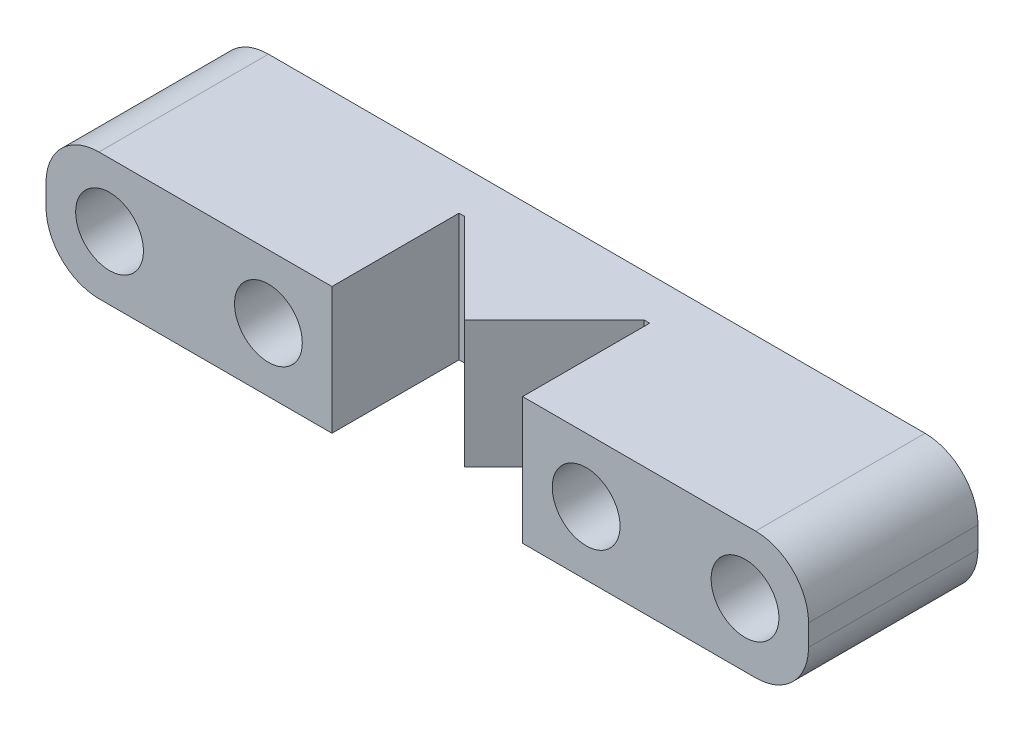
ISO-10303-21;
HEADER;
FILE_DESCRIPTION(('STEP AP214'),'2;1');
FILE_NAME('part.step','',(''),(''),'','','');
FILE_SCHEMA(('AUTOMOTIVE_DESIGN { 1 0 10303 214 1 1 1 1 }'));
ENDSEC;
DATA;
#1=APPLICATION_CONTEXT('core data for automotive mechanical design processes');
#2=APPLICATION_PROTOCOL_DEFINITION('international standard','automotive_design',2000,#1);
#3=PRODUCT_CONTEXT('',#1,'mechanical');
#4=PRODUCT('Part','Part','',(#3));
#5=PRODUCT_RELATED_PRODUCT_CATEGORY('part','',(#4));
#6=PRODUCT_DEFINITION_FORMATION('','',#4);
#7=PRODUCT_DEFINITION_CONTEXT('part definition',#1,'design');
#8=PRODUCT_DEFINITION('design','',#6,#7);
#9=PRODUCT_DEFINITION_SHAPE('','',#8);
#10=(LENGTH_UNIT() NAMED_UNIT(*) SI_UNIT(.MILLI.,.METRE.));
#11=(NAMED_UNIT(*) PLANE_ANGLE_UNIT() SI_UNIT($,.RADIAN.));
#12=(NAMED_UNIT(*) SI_UNIT($,.STERADIAN.) SOLID_ANGLE_UNIT());
#13=UNCERTAINTY_MEASURE_WITH_UNIT(LENGTH_MEASURE(1.E-05),#10,'distance_accuracy_value','');
#14=(GEOMETRIC_REPRESENTATION_CONTEXT(3) GLOBAL_UNCERTAINTY_ASSIGNED_CONTEXT((#13)) GLOBAL_UNIT_ASSIGNED_CONTEXT((#10,
#11,#12)) REPRESENTATION_CONTEXT('',''));
#15=CARTESIAN_POINT('',(0.,0.,0.));
#16=DIRECTION('',(0.,0.,1.));
#17=DIRECTION('',(1.,0.,0.));
#18=AXIS2_PLACEMENT_3D('',#15,#16,#17);
#19=CARTESIAN_POINT('',(3.,5.,2.));
#20=DIRECTION('',(0.,0.,-1.));
#21=DIRECTION('',(-1.,0.,0.));
#22=AXIS2_PLACEMENT_3D('',#19,#20,#21);
#23=PLANE('',#22);
#24=DIRECTION('',(1.,0.,0.));
#25=VECTOR('',#24,1.);
#26=CARTESIAN_POINT('',(3.,-3.,2.));
#27=LINE('',#26,#25);
#28=CARTESIAN_POINT('',(3.,-3.,2.));
#29=VERTEX_POINT('',#28);
#30=CARTESIAN_POINT('',(3.25735931288069,-3.,2.));
#31=VERTEX_POINT('',#30);
#32=EDGE_CURVE('E249',#29,#31,#27,.T.);
#33=ORIENTED_EDGE('',*,*,#32,.T.);
#34=DIRECTION('',(0.,-1.,0.));
#35=VECTOR('',#34,1.);
#36=CARTESIAN_POINT('',(3.25735931288069,12.4868329805051,2.));
#37=LINE('',#36,#35);
#38=CARTESIAN_POINT('',(3.25735931288069,3.,2.));
#39=VERTEX_POINT('',#38);
#40=EDGE_CURVE('E237',#39,#31,#37,.T.);
#41=ORIENTED_EDGE('',*,*,#40,.F.);
#42=DIRECTION('',(1.,0.,0.));
#43=VECTOR('',#42,1.);
#44=CARTESIAN_POINT('',(-0.499999999999983,3.,2.));
#45=LINE('',#44,#43);
#46=CARTESIAN_POINT('',(3.,3.,2.));
#47=VERTEX_POINT('',#46);
#48=EDGE_CURVE('E258',#47,#39,#45,.T.);
#49=ORIENTED_EDGE('',*,*,#48,.F.);
#50=DIRECTION('',(0.,-1.,0.));
#51=VECTOR('',#50,1.);
#52=CARTESIAN_POINT('',(3.,5.,2.));
#53=LINE('',#52,#51);
#54=EDGE_CURVE('E60',#47,#29,#53,.T.);
#55=ORIENTED_EDGE('',*,*,#54,.T.);
#56=EDGE_LOOP('',(#33,#41,#49,#55));
#57=FACE_BOUND('',#56,.T.);
#58=ADVANCED_FACE('F37',(#57),#23,.F.);
#59=CARTESIAN_POINT('',(15.5,-0.5,8.));
#60=DIRECTION('',(0.,0.,1.));
#61=DIRECTION('',(1.,0.,0.));
#62=AXIS2_PLACEMENT_3D('',#59,#60,#61);
#63=PLANE('',#62);
#64=DIRECTION('',(0.,-1.,0.));
#65=VECTOR('',#64,1.);
#66=CARTESIAN_POINT('',(3.,-0.5,8.));
#67=LINE('',#66,#65);
#68=CARTESIAN_POINT('',(3.,3.,8.));
#69=VERTEX_POINT('',#68);
#70=CARTESIAN_POINT('',(3.,-3.,8.));
#71=VERTEX_POINT('',#70);
#72=EDGE_CURVE('E268',#69,#71,#67,.T.);
#73=ORIENTED_EDGE('',*,*,#72,.F.);
#74=DIRECTION('',(-1.,0.,0.));
#75=VECTOR('',#74,1.);
#76=CARTESIAN_POINT('',(-0.499999999999983,3.,8.));
#77=LINE('',#76,#75);
#78=CARTESIAN_POINT('',(-8.,3.,8.));
#79=VERTEX_POINT('',#78);
#80=EDGE_CURVE('E283',#69,#79,#77,.T.);
#81=ORIENTED_EDGE('',*,*,#80,.T.);
#82=CARTESIAN_POINT('',(-8.,0.5,8.));
#83=DIRECTION('',(0.,0.,-1.));
#84=DIRECTION('',(-1.,0.,0.));
#85=AXIS2_PLACEMENT_3D('',#82,#83,#84);
#86=CIRCLE('',#85,2.5);
#87=CARTESIAN_POINT('',(-10.5,0.5,8.));
#88=VERTEX_POINT('',#87);
#89=EDGE_CURVE('E201',#79,#88,#86,.F.);
#90=ORIENTED_EDGE('',*,*,#89,.T.);
#91=DIRECTION('',(0.,-1.,0.));
#92=VECTOR('',#91,1.);
#93=CARTESIAN_POINT('',(-10.5,0.,8.));
#94=LINE('',#93,#92);
#95=CARTESIAN_POINT('',(-10.5,-0.5,8.));
#96=VERTEX_POINT('',#95);
#97=EDGE_CURVE('E208',#88,#96,#94,.T.);
#98=ORIENTED_EDGE('',*,*,#97,.T.);
#99=CARTESIAN_POINT('',(-8.,-0.5,8.));
#100=DIRECTION('',(0.,0.,-1.));
#101=DIRECTION('',(-1.,0.,0.));
#102=AXIS2_PLACEMENT_3D('',#99,#100,#101);
#103=CIRCLE('',#102,2.5);
#104=CARTESIAN_POINT('',(-8.,-3.,8.));
#105=VERTEX_POINT('',#104);
#106=EDGE_CURVE('E204',#105,#96,#103,.T.);
#107=ORIENTED_EDGE('',*,*,#106,.F.);
#108=DIRECTION('',(1.,0.,0.));
#109=VECTOR('',#108,1.);
#110=CARTESIAN_POINT('',(-0.499999999999982,-3.,8.));
#111=LINE('',#110,#109);
#112=EDGE_CURVE('E45',#105,#71,#111,.T.);
#113=ORIENTED_EDGE('',*,*,#112,.T.);
#114=EDGE_LOOP('',(#73,#81,#90,#98,#107,#113));
#115=FACE_BOUND('',#114,.T.);
#116=CARTESIAN_POINT('',(0.,0.,8.));
#117=DIRECTION('',(0.,0.,1.));
#118=DIRECTION('',(1.,0.,0.));
#119=AXIS2_PLACEMENT_3D('',#116,#117,#118);
#120=CIRCLE('',#119,1.6);
#121=CARTESIAN_POINT('',(1.6,0.,8.));
#122=VERTEX_POINT('',#121);
#123=EDGE_CURVE('E277',#122,#122,#120,.T.);
#124=ORIENTED_EDGE('',*,*,#123,.F.);
#125=EDGE_LOOP('',(#124));
#126=FACE_BOUND('',#125,.T.);
#127=CARTESIAN_POINT('',(-7.5,0.,8.));
#128=DIRECTION('',(0.,0.,-1.));
#129=DIRECTION('',(-1.,0.,0.));
#130=AXIS2_PLACEMENT_3D('',#127,#128,#129);
#131=CIRCLE('',#130,1.6);
#132=CARTESIAN_POINT('',(-9.1,0.,8.));
#133=VERTEX_POINT('',#132);
#134=EDGE_CURVE('E210',#133,#133,#131,.T.);
#135=ORIENTED_EDGE('',*,*,#134,.T.);
#136=EDGE_LOOP('',(#135));
#137=FACE_BOUND('',#136,.T.);
#138=ADVANCED_FACE('F290',(#115,#126,#137),#63,.T.);
#139=DIRECTION('',(0.,1.,0.));
#140=VECTOR('',#139,1.);
#141=CARTESIAN_POINT('',(12.,-0.5,8.));
#142=LINE('',#141,#140);
#143=CARTESIAN_POINT('',(12.,-3.,8.));
#144=VERTEX_POINT('',#143);
#145=CARTESIAN_POINT('',(12.,3.,8.));
#146=VERTEX_POINT('',#145);
#147=EDGE_CURVE('E155',#144,#146,#142,.T.);
#148=ORIENTED_EDGE('',*,*,#147,.F.);
#149=CARTESIAN_POINT('',(23.,-3.,8.));
#150=VERTEX_POINT('',#149);
#151=EDGE_CURVE('E146',#144,#150,#111,.T.);
#152=ORIENTED_EDGE('',*,*,#151,.T.);
#153=CARTESIAN_POINT('',(23.,-0.499999999999998,8.));
#154=DIRECTION('',(0.,0.,-1.));
#155=DIRECTION('',(-1.,0.,0.));
#156=AXIS2_PLACEMENT_3D('',#153,#154,#155);
#157=CIRCLE('',#156,2.5);
#158=CARTESIAN_POINT('',(25.5,-0.499999999999998,8.));
#159=VERTEX_POINT('',#158);
#160=EDGE_CURVE('E152',#150,#159,#157,.F.);
#161=ORIENTED_EDGE('',*,*,#160,.T.);
#162=DIRECTION('',(0.,-1.,0.));
#163=VECTOR('',#162,1.);
#164=CARTESIAN_POINT('',(25.5,0.,8.));
#165=LINE('',#164,#163);
#166=CARTESIAN_POINT('',(25.5,0.500000000000002,8.));
#167=VERTEX_POINT('',#166);
#168=EDGE_CURVE('E179',#167,#159,#165,.T.);
#169=ORIENTED_EDGE('',*,*,#168,.F.);
#170=CARTESIAN_POINT('',(23.,0.500000000000002,8.));
#171=DIRECTION('',(0.,0.,-1.));
#172=DIRECTION('',(-1.,0.,0.));
#173=AXIS2_PLACEMENT_3D('',#170,#171,#172);
#174=CIRCLE('',#173,2.5);
#175=CARTESIAN_POINT('',(23.,3.,8.));
#176=VERTEX_POINT('',#175);
#177=EDGE_CURVE('E175',#176,#167,#174,.T.);
#178=ORIENTED_EDGE('',*,*,#177,.F.);
#179=EDGE_CURVE('E158',#176,#146,#77,.T.);
#180=ORIENTED_EDGE('',*,*,#179,.T.);
#181=EDGE_LOOP('',(#148,#152,#161,#169,#178,#180));
#182=FACE_BOUND('',#181,.T.);
#183=CARTESIAN_POINT('',(15.,0.,8.));
#184=DIRECTION('',(0.,0.,1.));
#185=DIRECTION('',(1.,0.,0.));
#186=AXIS2_PLACEMENT_3D('',#183,#184,#185);
#187=CIRCLE('',#186,1.6);
#188=CARTESIAN_POINT('',(16.6,0.,8.));
#189=VERTEX_POINT('',#188);
#190=EDGE_CURVE('E271',#189,#189,#187,.T.);
#191=ORIENTED_EDGE('',*,*,#190,.F.);
#192=EDGE_LOOP('',(#191));
#193=FACE_BOUND('',#192,.T.);
#194=CARTESIAN_POINT('',(22.5,0.,8.));
#195=DIRECTION('',(0.,0.,-1.));
#196=DIRECTION('',(-1.,0.,0.));
#197=AXIS2_PLACEMENT_3D('',#194,#195,#196);
#198=CIRCLE('',#197,1.6);
#199=CARTESIAN_POINT('',(20.9,0.,8.));
#200=VERTEX_POINT('',#199);
#201=EDGE_CURVE('E170',#200,#200,#198,.F.);
#202=ORIENTED_EDGE('',*,*,#201,.F.);
#203=EDGE_LOOP('',(#202));
#204=FACE_BOUND('',#203,.T.);
#205=ADVANCED_FACE('F148',(#182,#193,#204),#63,.T.);
#206=CARTESIAN_POINT('',(15.5,-0.5,0.));
#207=DIRECTION('',(0.,0.,1.));
#208=DIRECTION('',(1.,0.,0.));
#209=AXIS2_PLACEMENT_3D('',#206,#207,#208);
#210=PLANE('',#209);
#211=CARTESIAN_POINT('',(23.,-0.499999999999998,0.));
#212=DIRECTION('',(0.,0.,-1.));
#213=DIRECTION('',(-1.,0.,0.));
#214=AXIS2_PLACEMENT_3D('',#211,#212,#213);
#215=CIRCLE('',#214,2.5);
#216=CARTESIAN_POINT('',(23.,-3.,0.));
#217=VERTEX_POINT('',#216);
#218=CARTESIAN_POINT('',(25.5,-0.499999999999998,0.));
#219=VERTEX_POINT('',#218);
#220=EDGE_CURVE('E188',#217,#219,#215,.F.);
#221=ORIENTED_EDGE('',*,*,#220,.F.);
#222=DIRECTION('',(1.,0.,0.));
#223=VECTOR('',#222,1.);
#224=CARTESIAN_POINT('',(-0.499999999999982,-3.,0.));
#225=LINE('',#224,#223);
#226=CARTESIAN_POINT('',(-8.,-3.,0.));
#227=VERTEX_POINT('',#226);
#228=EDGE_CURVE('E165',#227,#217,#225,.T.);
#229=ORIENTED_EDGE('',*,*,#228,.F.);
#230=CARTESIAN_POINT('',(-8.,-0.5,0.));
#231=DIRECTION('',(0.,0.,-1.));
#232=DIRECTION('',(-1.,0.,0.));
#233=AXIS2_PLACEMENT_3D('',#230,#231,#232);
#234=CIRCLE('',#233,2.5);
#235=CARTESIAN_POINT('',(-10.5,-0.5,0.));
#236=VERTEX_POINT('',#235);
#237=EDGE_CURVE('E216',#227,#236,#234,.T.);
#238=ORIENTED_EDGE('',*,*,#237,.T.);
#239=DIRECTION('',(0.,-1.,0.));
#240=VECTOR('',#239,1.);
#241=CARTESIAN_POINT('',(-10.5,0.,0.));
#242=LINE('',#241,#240);
#243=CARTESIAN_POINT('',(-10.5,0.5,0.));
#244=VERTEX_POINT('',#243);
#245=EDGE_CURVE('E219',#244,#236,#242,.T.);
#246=ORIENTED_EDGE('',*,*,#245,.F.);
#247=CARTESIAN_POINT('',(-8.,0.5,0.));
#248=DIRECTION('',(0.,0.,-1.));
#249=DIRECTION('',(-1.,0.,0.));
#250=AXIS2_PLACEMENT_3D('',#247,#248,#249);
#251=CIRCLE('',#250,2.5);
#252=CARTESIAN_POINT('',(-8.,3.,0.));
#253=VERTEX_POINT('',#252);
#254=EDGE_CURVE('E196',#253,#244,#251,.F.);
#255=ORIENTED_EDGE('',*,*,#254,.F.);
#256=DIRECTION('',(-1.,0.,0.));
#257=VECTOR('',#256,1.);
#258=CARTESIAN_POINT('',(-0.499999999999983,3.,0.));
#259=LINE('',#258,#257);
#260=CARTESIAN_POINT('',(23.,3.,0.));
#261=VERTEX_POINT('',#260);
#262=EDGE_CURVE('E280',#261,#253,#259,.T.);
#263=ORIENTED_EDGE('',*,*,#262,.F.);
#264=CARTESIAN_POINT('',(23.,0.500000000000002,0.));
#265=DIRECTION('',(0.,0.,-1.));
#266=DIRECTION('',(-1.,0.,0.));
#267=AXIS2_PLACEMENT_3D('',#264,#265,#266);
#268=CIRCLE('',#267,2.5);
#269=CARTESIAN_POINT('',(25.5,0.500000000000002,0.));
#270=VERTEX_POINT('',#269);
#271=EDGE_CURVE('E190',#261,#270,#268,.T.);
#272=ORIENTED_EDGE('',*,*,#271,.T.);
#273=DIRECTION('',(0.,-1.,0.));
#274=VECTOR('',#273,1.);
#275=CARTESIAN_POINT('',(25.5,0.,0.));
#276=LINE('',#275,#274);
#277=EDGE_CURVE('E182',#270,#219,#276,.T.);
#278=ORIENTED_EDGE('',*,*,#277,.T.);
#279=EDGE_LOOP('',(#221,#229,#238,#246,#255,#263,#272,#278));
#280=FACE_BOUND('',#279,.T.);
#281=CARTESIAN_POINT('',(0.,0.,0.));
#282=DIRECTION('',(0.,0.,1.));
#283=DIRECTION('',(1.,0.,0.));
#284=AXIS2_PLACEMENT_3D('',#281,#282,#283);
#285=CIRCLE('',#284,1.6);
#286=CARTESIAN_POINT('',(1.6,0.,0.));
#287=VERTEX_POINT('',#286);
#288=EDGE_CURVE('E274',#287,#287,#285,.T.);
#289=ORIENTED_EDGE('',*,*,#288,.T.);
#290=EDGE_LOOP('',(#289));
#291=FACE_BOUND('',#290,.T.);
#292=CARTESIAN_POINT('',(15.,0.,0.));
#293=DIRECTION('',(0.,0.,1.));
#294=DIRECTION('',(1.,0.,0.));
#295=AXIS2_PLACEMENT_3D('',#292,#293,#294);
#296=CIRCLE('',#295,1.6);
#297=CARTESIAN_POINT('',(16.6,0.,0.));
#298=VERTEX_POINT('',#297);
#299=EDGE_CURVE('E270',#298,#298,#296,.T.);
#300=ORIENTED_EDGE('',*,*,#299,.T.);
#301=EDGE_LOOP('',(#300));
#302=FACE_BOUND('',#301,.T.);
#303=CARTESIAN_POINT('',(-7.5,0.,0.));
#304=DIRECTION('',(0.,0.,-1.));
#305=DIRECTION('',(-1.,0.,0.));
#306=AXIS2_PLACEMENT_3D('',#303,#304,#305);
#307=CIRCLE('',#306,1.6);
#308=CARTESIAN_POINT('',(-9.1,0.,0.));
#309=VERTEX_POINT('',#308);
#310=EDGE_CURVE('E205',#309,#309,#307,.T.);
#311=ORIENTED_EDGE('',*,*,#310,.F.);
#312=EDGE_LOOP('',(#311));
#313=FACE_BOUND('',#312,.T.);
#314=CARTESIAN_POINT('',(22.5,0.,0.));
#315=DIRECTION('',(0.,0.,-1.));
#316=DIRECTION('',(-1.,0.,0.));
#317=AXIS2_PLACEMENT_3D('',#314,#315,#316);
#318=CIRCLE('',#317,1.6);
#319=CARTESIAN_POINT('',(20.9,0.,0.));
#320=VERTEX_POINT('',#319);
#321=EDGE_CURVE('E176',#320,#320,#318,.F.);
#322=ORIENTED_EDGE('',*,*,#321,.T.);
#323=EDGE_LOOP('',(#322));
#324=FACE_BOUND('',#323,.T.);
#325=ADVANCED_FACE('F353',(#280,#291,#302,#313,#324),#210,.F.);
#326=CARTESIAN_POINT('',(-0.499999999999983,3.,8.));
#327=DIRECTION('',(0.,-1.,0.));
#328=DIRECTION('',(0.,0.,-1.));
#329=AXIS2_PLACEMENT_3D('',#326,#327,#328);
#330=PLANE('',#329);
#331=ORIENTED_EDGE('',*,*,#80,.F.);
#332=DIRECTION('',(0.,0.,-1.));
#333=VECTOR('',#332,1.);
#334=CARTESIAN_POINT('',(3.,3.,8.));
#335=LINE('',#334,#333);
#336=EDGE_CURVE('E265',#69,#47,#335,.T.);
#337=ORIENTED_EDGE('',*,*,#336,.T.);
#338=ORIENTED_EDGE('',*,*,#48,.T.);
#339=DIRECTION('',(0.707106781186551,0.,0.707106781186544));
#340=VECTOR('',#339,1.);
#341=CARTESIAN_POINT('',(3.25735931288069,3.,2.));
#342=LINE('',#341,#340);
#343=CARTESIAN_POINT('',(7.5,3.,6.24264068711926));
#344=VERTEX_POINT('',#343);
#345=EDGE_CURVE('E234',#39,#344,#342,.T.);
#346=ORIENTED_EDGE('',*,*,#345,.T.);
#347=DIRECTION('',(0.707106781186542,0.,-0.707106781186554));
#348=VECTOR('',#347,1.);
#349=CARTESIAN_POINT('',(7.5,3.,6.24264068711926));
#350=LINE('',#349,#348);
#351=CARTESIAN_POINT('',(11.7426406871192,3.,2.));
#352=VERTEX_POINT('',#351);
#353=EDGE_CURVE('E236',#344,#352,#350,.T.);
#354=ORIENTED_EDGE('',*,*,#353,.T.);
#355=CARTESIAN_POINT('',(12.,3.,2.));
#356=VERTEX_POINT('',#355);
#357=EDGE_CURVE('E256',#352,#356,#45,.T.);
#358=ORIENTED_EDGE('',*,*,#357,.T.);
#359=DIRECTION('',(0.,0.,1.));
#360=VECTOR('',#359,1.);
#361=CARTESIAN_POINT('',(12.,3.,8.));
#362=LINE('',#361,#360);
#363=EDGE_CURVE('E261',#356,#146,#362,.T.);
#364=ORIENTED_EDGE('',*,*,#363,.T.);
#365=ORIENTED_EDGE('',*,*,#179,.F.);
#366=DIRECTION('',(0.,0.,-1.));
#367=VECTOR('',#366,1.);
#368=CARTESIAN_POINT('',(23.,3.,8.));
#369=LINE('',#368,#367);
#370=EDGE_CURVE('E169',#176,#261,#369,.T.);
#371=ORIENTED_EDGE('',*,*,#370,.T.);
#372=ORIENTED_EDGE('',*,*,#262,.T.);
#373=DIRECTION('',(0.,0.,-1.));
#374=VECTOR('',#373,1.);
#375=CARTESIAN_POINT('',(-8.,3.,8.));
#376=LINE('',#375,#374);
#377=EDGE_CURVE('E213',#79,#253,#376,.T.);
#378=ORIENTED_EDGE('',*,*,#377,.F.);
#379=EDGE_LOOP('',(#331,#337,#338,#346,#354,#358,#364,#365,#371,#372,#378));
#380=FACE_BOUND('',#379,.T.);
#381=ADVANCED_FACE('F39',(#380),#330,.F.);
#382=CARTESIAN_POINT('',(-0.499999999999982,-3.,8.));
#383=DIRECTION('',(0.,1.,0.));
#384=DIRECTION('',(0.,0.,1.));
#385=AXIS2_PLACEMENT_3D('',#382,#383,#384);
#386=PLANE('',#385);
#387=ORIENTED_EDGE('',*,*,#32,.F.);
#388=DIRECTION('',(0.,0.,1.));
#389=VECTOR('',#388,1.);
#390=CARTESIAN_POINT('',(3.,-3.,8.));
#391=LINE('',#390,#389);
#392=EDGE_CURVE('E12',#29,#71,#391,.T.);
#393=ORIENTED_EDGE('',*,*,#392,.T.);
#394=ORIENTED_EDGE('',*,*,#112,.F.);
#395=DIRECTION('',(0.,0.,-1.));
#396=VECTOR('',#395,1.);
#397=CARTESIAN_POINT('',(-8.,-3.,8.));
#398=LINE('',#397,#396);
#399=EDGE_CURVE('E230',#105,#227,#398,.T.);
#400=ORIENTED_EDGE('',*,*,#399,.T.);
#401=ORIENTED_EDGE('',*,*,#228,.T.);
#402=DIRECTION('',(0.,0.,-1.));
#403=VECTOR('',#402,1.);
#404=CARTESIAN_POINT('',(23.,-3.,8.));
#405=LINE('',#404,#403);
#406=EDGE_CURVE('E161',#150,#217,#405,.T.);
#407=ORIENTED_EDGE('',*,*,#406,.F.);
#408=ORIENTED_EDGE('',*,*,#151,.F.);
#409=DIRECTION('',(0.,0.,1.));
#410=VECTOR('',#409,1.);
#411=CARTESIAN_POINT('',(12.,-3.,10.1997119874976));
#412=LINE('',#411,#410);
#413=CARTESIAN_POINT('',(12.,-3.,2.));
#414=VERTEX_POINT('',#413);
#415=EDGE_CURVE('E251',#414,#144,#412,.T.);
#416=ORIENTED_EDGE('',*,*,#415,.F.);
#417=CARTESIAN_POINT('',(11.7426406871192,-3.,2.));
#418=VERTEX_POINT('',#417);
#419=EDGE_CURVE('E248',#418,#414,#27,.T.);
#420=ORIENTED_EDGE('',*,*,#419,.F.);
#421=DIRECTION('',(-0.707106781186542,0.,0.707106781186554));
#422=VECTOR('',#421,1.);
#423=CARTESIAN_POINT('',(7.5,-3.,6.24264068711926));
#424=LINE('',#423,#422);
#425=CARTESIAN_POINT('',(7.5,-3.,6.24264068711926));
#426=VERTEX_POINT('',#425);
#427=EDGE_CURVE('E227',#418,#426,#424,.T.);
#428=ORIENTED_EDGE('',*,*,#427,.T.);
#429=DIRECTION('',(-0.707106781186551,0.,-0.707106781186544));
#430=VECTOR('',#429,1.);
#431=CARTESIAN_POINT('',(3.25735931288069,-3.,2.));
#432=LINE('',#431,#430);
#433=EDGE_CURVE('E240',#426,#31,#432,.T.);
#434=ORIENTED_EDGE('',*,*,#433,.T.);
#435=EDGE_LOOP('',(#387,#393,#394,#400,#401,#407,#408,#416,#420,#428,#434));
#436=FACE_BOUND('',#435,.T.);
#437=ADVANCED_FACE('F163',(#436),#386,.F.);
#438=CARTESIAN_POINT('',(0.,0.,8.));
#439=DIRECTION('',(0.,0.,-1.));
#440=DIRECTION('',(-1.,0.,0.));
#441=AXIS2_PLACEMENT_3D('',#438,#439,#440);
#442=CYLINDRICAL_SURFACE('',#441,1.6);
#443=ORIENTED_EDGE('',*,*,#123,.T.);
#444=EDGE_LOOP('',(#443));
#445=FACE_BOUND('',#444,.T.);
#446=ORIENTED_EDGE('',*,*,#288,.F.);
#447=EDGE_LOOP('',(#446));
#448=FACE_BOUND('',#447,.T.);
#449=ADVANCED_FACE('F343',(#445,#448),#442,.F.);
#450=CARTESIAN_POINT('',(15.,0.,8.));
#451=DIRECTION('',(0.,0.,-1.));
#452=DIRECTION('',(-1.,0.,0.));
#453=AXIS2_PLACEMENT_3D('',#450,#451,#452);
#454=CYLINDRICAL_SURFACE('',#453,1.6);
#455=ORIENTED_EDGE('',*,*,#190,.T.);
#456=EDGE_LOOP('',(#455));
#457=FACE_BOUND('',#456,.T.);
#458=ORIENTED_EDGE('',*,*,#299,.F.);
#459=EDGE_LOOP('',(#458));
#460=FACE_BOUND('',#459,.T.);
#461=ADVANCED_FACE('F339',(#457,#460),#454,.F.);
#462=ORIENTED_EDGE('',*,*,#357,.F.);
#463=DIRECTION('',(0.,-1.,0.));
#464=VECTOR('',#463,1.);
#465=CARTESIAN_POINT('',(11.7426406871192,12.4868329805051,2.));
#466=LINE('',#465,#464);
#467=EDGE_CURVE('E52',#352,#418,#466,.T.);
#468=ORIENTED_EDGE('',*,*,#467,.T.);
#469=ORIENTED_EDGE('',*,*,#419,.T.);
#470=DIRECTION('',(0.,-1.,0.));
#471=VECTOR('',#470,1.);
#472=CARTESIAN_POINT('',(12.,5.,2.));
#473=LINE('',#472,#471);
#474=EDGE_CURVE('E253',#356,#414,#473,.T.);
#475=ORIENTED_EDGE('',*,*,#474,.F.);
#476=EDGE_LOOP('',(#462,#468,#469,#475));
#477=FACE_BOUND('',#476,.T.);
#478=ADVANCED_FACE('F317',(#477),#23,.F.);
#479=CARTESIAN_POINT('',(3.,5.,10.1997119874976));
#480=DIRECTION('',(-1.,0.,0.));
#481=DIRECTION('',(0.,0.,1.));
#482=AXIS2_PLACEMENT_3D('',#479,#480,#481);
#483=PLANE('',#482);
#484=ORIENTED_EDGE('',*,*,#72,.T.);
#485=ORIENTED_EDGE('',*,*,#392,.F.);
#486=ORIENTED_EDGE('',*,*,#54,.F.);
#487=ORIENTED_EDGE('',*,*,#336,.F.);
#488=EDGE_LOOP('',(#484,#485,#486,#487));
#489=FACE_BOUND('',#488,.T.);
#490=ADVANCED_FACE('F307',(#489),#483,.F.);
#491=CARTESIAN_POINT('',(12.,5.,10.1997119874976));
#492=DIRECTION('',(1.,0.,0.));
#493=DIRECTION('',(0.,0.,-1.));
#494=AXIS2_PLACEMENT_3D('',#491,#492,#493);
#495=PLANE('',#494);
#496=ORIENTED_EDGE('',*,*,#147,.T.);
#497=ORIENTED_EDGE('',*,*,#363,.F.);
#498=ORIENTED_EDGE('',*,*,#474,.T.);
#499=ORIENTED_EDGE('',*,*,#415,.T.);
#500=EDGE_LOOP('',(#496,#497,#498,#499));
#501=FACE_BOUND('',#500,.T.);
#502=ADVANCED_FACE('F321',(#501),#495,.F.);
#503=CARTESIAN_POINT('',(3.25735931288069,12.4868329805051,2.));
#504=DIRECTION('',(-0.707106781186544,0.,0.707106781186551));
#505=DIRECTION('',(0.707106781186551,0.,0.707106781186544));
#506=AXIS2_PLACEMENT_3D('',#503,#504,#505);
#507=PLANE('',#506);
#508=ORIENTED_EDGE('',*,*,#345,.F.);
#509=ORIENTED_EDGE('',*,*,#40,.T.);
#510=ORIENTED_EDGE('',*,*,#433,.F.);
#511=DIRECTION('',(0.,-1.,0.));
#512=VECTOR('',#511,1.);
#513=CARTESIAN_POINT('',(7.5,12.4868329805051,6.24264068711926));
#514=LINE('',#513,#512);
#515=EDGE_CURVE('E244',#344,#426,#514,.T.);
#516=ORIENTED_EDGE('',*,*,#515,.F.);
#517=EDGE_LOOP('',(#508,#509,#510,#516));
#518=FACE_BOUND('',#517,.T.);
#519=ADVANCED_FACE('F312',(#518),#507,.T.);
#520=CARTESIAN_POINT('',(7.5,12.4868329805051,6.24264068711926));
#521=DIRECTION('',(0.707106781186554,0.,0.707106781186542));
#522=DIRECTION('',(0.707106781186542,0.,-0.707106781186554));
#523=AXIS2_PLACEMENT_3D('',#520,#521,#522);
#524=PLANE('',#523);
#525=ORIENTED_EDGE('',*,*,#353,.F.);
#526=ORIENTED_EDGE('',*,*,#515,.T.);
#527=ORIENTED_EDGE('',*,*,#427,.F.);
#528=ORIENTED_EDGE('',*,*,#467,.F.);
#529=EDGE_LOOP('',(#525,#526,#527,#528));
#530=FACE_BOUND('',#529,.T.);
#531=ADVANCED_FACE('F314',(#530),#524,.T.);
#532=CARTESIAN_POINT('',(-8.,0.5,8.));
#533=DIRECTION('',(0.,0.,-1.));
#534=DIRECTION('',(-1.,0.,0.));
#535=AXIS2_PLACEMENT_3D('',#532,#533,#534);
#536=CYLINDRICAL_SURFACE('',#535,2.5);
#537=ORIENTED_EDGE('',*,*,#254,.T.);
#538=DIRECTION('',(0.,0.,-1.));
#539=VECTOR('',#538,1.);
#540=CARTESIAN_POINT('',(-10.5,0.5,8.));
#541=LINE('',#540,#539);
#542=EDGE_CURVE('E224',#88,#244,#541,.T.);
#543=ORIENTED_EDGE('',*,*,#542,.F.);
#544=ORIENTED_EDGE('',*,*,#89,.F.);
#545=ORIENTED_EDGE('',*,*,#377,.T.);
#546=EDGE_LOOP('',(#537,#543,#544,#545));
#547=FACE_BOUND('',#546,.T.);
#548=ADVANCED_FACE('F297',(#547),#536,.T.);
#549=CARTESIAN_POINT('',(-10.5,0.,8.));
#550=DIRECTION('',(1.,0.,0.));
#551=DIRECTION('',(0.,1.,0.));
#552=AXIS2_PLACEMENT_3D('',#549,#550,#551);
#553=PLANE('',#552);
#554=ORIENTED_EDGE('',*,*,#245,.T.);
#555=DIRECTION('',(0.,0.,-1.));
#556=VECTOR('',#555,1.);
#557=CARTESIAN_POINT('',(-10.5,-0.5,8.));
#558=LINE('',#557,#556);
#559=EDGE_CURVE('E228',#96,#236,#558,.T.);
#560=ORIENTED_EDGE('',*,*,#559,.F.);
#561=ORIENTED_EDGE('',*,*,#97,.F.);
#562=ORIENTED_EDGE('',*,*,#542,.T.);
#563=EDGE_LOOP('',(#554,#560,#561,#562));
#564=FACE_BOUND('',#563,.T.);
#565=ADVANCED_FACE('F299',(#564),#553,.F.);
#566=CARTESIAN_POINT('',(-8.,-0.5,8.));
#567=DIRECTION('',(0.,0.,-1.));
#568=DIRECTION('',(-1.,0.,0.));
#569=AXIS2_PLACEMENT_3D('',#566,#567,#568);
#570=CYLINDRICAL_SURFACE('',#569,2.5);
#571=ORIENTED_EDGE('',*,*,#237,.F.);
#572=ORIENTED_EDGE('',*,*,#399,.F.);
#573=ORIENTED_EDGE('',*,*,#106,.T.);
#574=ORIENTED_EDGE('',*,*,#559,.T.);
#575=EDGE_LOOP('',(#571,#572,#573,#574));
#576=FACE_BOUND('',#575,.T.);
#577=ADVANCED_FACE('F305',(#576),#570,.T.);
#578=CARTESIAN_POINT('',(-7.5,0.,8.));
#579=DIRECTION('',(0.,0.,-1.));
#580=DIRECTION('',(-1.,0.,0.));
#581=AXIS2_PLACEMENT_3D('',#578,#579,#580);
#582=CYLINDRICAL_SURFACE('',#581,1.6);
#583=ORIENTED_EDGE('',*,*,#134,.F.);
#584=EDGE_LOOP('',(#583));
#585=FACE_BOUND('',#584,.T.);
#586=ORIENTED_EDGE('',*,*,#310,.T.);
#587=EDGE_LOOP('',(#586));
#588=FACE_BOUND('',#587,.T.);
#589=ADVANCED_FACE('F479',(#585,#588),#582,.F.);
#590=CARTESIAN_POINT('',(23.,-0.499999999999998,8.));
#591=DIRECTION('',(0.,0.,-1.));
#592=DIRECTION('',(-1.,0.,0.));
#593=AXIS2_PLACEMENT_3D('',#590,#591,#592);
#594=CYLINDRICAL_SURFACE('',#593,2.5);
#595=ORIENTED_EDGE('',*,*,#220,.T.);
#596=DIRECTION('',(0.,0.,-1.));
#597=VECTOR('',#596,1.);
#598=CARTESIAN_POINT('',(25.5,-0.499999999999998,8.));
#599=LINE('',#598,#597);
#600=EDGE_CURVE('E173',#159,#219,#599,.T.);
#601=ORIENTED_EDGE('',*,*,#600,.F.);
#602=ORIENTED_EDGE('',*,*,#160,.F.);
#603=ORIENTED_EDGE('',*,*,#406,.T.);
#604=EDGE_LOOP('',(#595,#601,#602,#603));
#605=FACE_BOUND('',#604,.T.);
#606=ADVANCED_FACE('F172',(#605),#594,.T.);
#607=CARTESIAN_POINT('',(25.5,0.,8.));
#608=DIRECTION('',(1.,0.,0.));
#609=DIRECTION('',(0.,1.,0.));
#610=AXIS2_PLACEMENT_3D('',#607,#608,#609);
#611=PLANE('',#610);
#612=ORIENTED_EDGE('',*,*,#277,.F.);
#613=DIRECTION('',(0.,0.,-1.));
#614=VECTOR('',#613,1.);
#615=CARTESIAN_POINT('',(25.5,0.500000000000002,8.));
#616=LINE('',#615,#614);
#617=EDGE_CURVE('E197',#167,#270,#616,.T.);
#618=ORIENTED_EDGE('',*,*,#617,.F.);
#619=ORIENTED_EDGE('',*,*,#168,.T.);
#620=ORIENTED_EDGE('',*,*,#600,.T.);
#621=EDGE_LOOP('',(#612,#618,#619,#620));
#622=FACE_BOUND('',#621,.T.);
#623=ADVANCED_FACE('F495',(#622),#611,.T.);
#624=CARTESIAN_POINT('',(23.,0.500000000000002,8.));
#625=DIRECTION('',(0.,0.,-1.));
#626=DIRECTION('',(-1.,0.,0.));
#627=AXIS2_PLACEMENT_3D('',#624,#625,#626);
#628=CYLINDRICAL_SURFACE('',#627,2.5);
#629=ORIENTED_EDGE('',*,*,#271,.F.);
#630=ORIENTED_EDGE('',*,*,#370,.F.);
#631=ORIENTED_EDGE('',*,*,#177,.T.);
#632=ORIENTED_EDGE('',*,*,#617,.T.);
#633=EDGE_LOOP('',(#629,#630,#631,#632));
#634=FACE_BOUND('',#633,.T.);
#635=ADVANCED_FACE('F503',(#634),#628,.T.);
#636=CARTESIAN_POINT('',(22.5,0.,8.));
#637=DIRECTION('',(0.,0.,-1.));
#638=DIRECTION('',(-1.,0.,0.));
#639=AXIS2_PLACEMENT_3D('',#636,#637,#638);
#640=CYLINDRICAL_SURFACE('',#639,1.6);
#641=ORIENTED_EDGE('',*,*,#201,.T.);
#642=EDGE_LOOP('',(#641));
#643=FACE_BOUND('',#642,.T.);
#644=ORIENTED_EDGE('',*,*,#321,.F.);
#645=EDGE_LOOP('',(#644));
#646=FACE_BOUND('',#645,.T.);
#647=ADVANCED_FACE('F512',(#643,#646),#640,.F.);
#648=CLOSED_SHELL('',(#58,#138,#205,#325,#381,#437,#449,#461,#478,#490,#502,#519,#531,#548,#565,
#577,#589,#606,#623,#635,#647));
#649=MANIFOLD_SOLID_BREP('B2',#648);
#650=ADVANCED_BREP_SHAPE_REPRESENTATION('',(#18,#649),#14);
#651=SHAPE_DEFINITION_REPRESENTATION(#9,#650);
ENDSEC;
END-ISO-10303-21;
